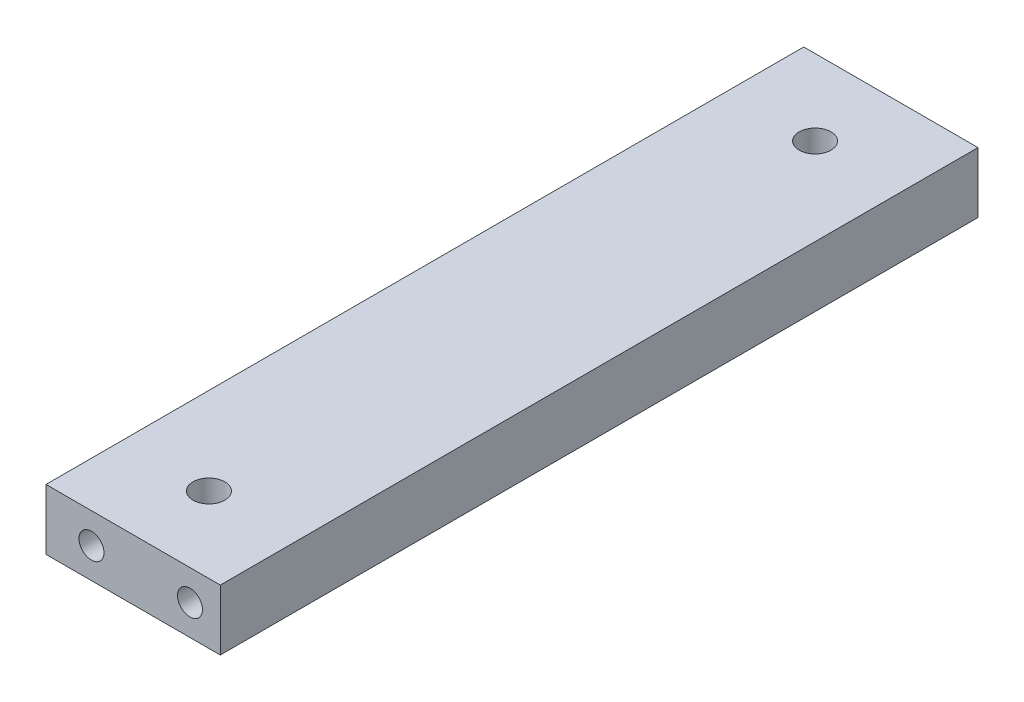
ISO-10303-21;
HEADER;
FILE_DESCRIPTION(('STEP AP214'),'2;1');
FILE_NAME('part.step','',(''),(''),'','','');
FILE_SCHEMA(('AUTOMOTIVE_DESIGN { 1 0 10303 214 1 1 1 1 }'));
ENDSEC;
DATA;
#1=APPLICATION_CONTEXT('core data for automotive mechanical design processes');
#2=APPLICATION_PROTOCOL_DEFINITION('international standard','automotive_design',2000,#1);
#3=PRODUCT_CONTEXT('',#1,'mechanical');
#4=PRODUCT('Part','Part','',(#3));
#5=PRODUCT_RELATED_PRODUCT_CATEGORY('part','',(#4));
#6=PRODUCT_DEFINITION_FORMATION('','',#4);
#7=PRODUCT_DEFINITION_CONTEXT('part definition',#1,'design');
#8=PRODUCT_DEFINITION('design','',#6,#7);
#9=PRODUCT_DEFINITION_SHAPE('','',#8);
#10=(LENGTH_UNIT() NAMED_UNIT(*) SI_UNIT(.MILLI.,.METRE.));
#11=(NAMED_UNIT(*) PLANE_ANGLE_UNIT() SI_UNIT($,.RADIAN.));
#12=(NAMED_UNIT(*) SI_UNIT($,.STERADIAN.) SOLID_ANGLE_UNIT());
#13=UNCERTAINTY_MEASURE_WITH_UNIT(LENGTH_MEASURE(1.E-05),#10,'distance_accuracy_value','');
#14=(GEOMETRIC_REPRESENTATION_CONTEXT(3) GLOBAL_UNCERTAINTY_ASSIGNED_CONTEXT((#13)) GLOBAL_UNIT_ASSIGNED_CONTEXT((#10,
#11,#12)) REPRESENTATION_CONTEXT('',''));
#15=CARTESIAN_POINT('',(0.,0.,0.));
#16=DIRECTION('',(0.,0.,1.));
#17=DIRECTION('',(1.,0.,0.));
#18=AXIS2_PLACEMENT_3D('',#15,#16,#17);
#19=CARTESIAN_POINT('',(0.,0.,100.));
#20=DIRECTION('',(1.,0.,0.));
#21=DIRECTION('',(0.,0.,-1.));
#22=AXIS2_PLACEMENT_3D('',#19,#20,#21);
#23=PLANE('',#22);
#24=DIRECTION('',(0.,-1.,0.));
#25=VECTOR('',#24,1.);
#26=CARTESIAN_POINT('',(0.,0.,0.));
#27=LINE('',#26,#25);
#28=CARTESIAN_POINT('',(0.,8.,0.));
#29=VERTEX_POINT('',#28);
#30=CARTESIAN_POINT('',(0.,0.,0.));
#31=VERTEX_POINT('',#30);
#32=EDGE_CURVE('E130',#29,#31,#27,.T.);
#33=ORIENTED_EDGE('',*,*,#32,.T.);
#34=DIRECTION('',(0.,0.,-1.));
#35=VECTOR('',#34,1.);
#36=CARTESIAN_POINT('',(0.,0.,100.));
#37=LINE('',#36,#35);
#38=CARTESIAN_POINT('',(0.,0.,100.));
#39=VERTEX_POINT('',#38);
#40=EDGE_CURVE('E11',#39,#31,#37,.T.);
#41=ORIENTED_EDGE('',*,*,#40,.F.);
#42=DIRECTION('',(0.,-1.,0.));
#43=VECTOR('',#42,1.);
#44=CARTESIAN_POINT('',(0.,0.,100.));
#45=LINE('',#44,#43);
#46=CARTESIAN_POINT('',(0.,8.,100.));
#47=VERTEX_POINT('',#46);
#48=EDGE_CURVE('E139',#47,#39,#45,.T.);
#49=ORIENTED_EDGE('',*,*,#48,.F.);
#50=DIRECTION('',(0.,0.,-1.));
#51=VECTOR('',#50,1.);
#52=CARTESIAN_POINT('',(0.,8.,100.));
#53=LINE('',#52,#51);
#54=EDGE_CURVE('E145',#47,#29,#53,.T.);
#55=ORIENTED_EDGE('',*,*,#54,.T.);
#56=EDGE_LOOP('',(#33,#41,#49,#55));
#57=FACE_BOUND('',#56,.T.);
#58=CARTESIAN_POINT('',(0.,4.,4.));
#59=DIRECTION('',(-1.,0.,0.));
#60=DIRECTION('',(0.,0.,1.));
#61=AXIS2_PLACEMENT_3D('',#58,#59,#60);
#62=CIRCLE('',#61,1.24999999999999);
#63=CARTESIAN_POINT('',(0.,4.,5.24999999999999));
#64=VERTEX_POINT('',#63);
#65=EDGE_CURVE('E227',#64,#64,#62,.T.);
#66=ORIENTED_EDGE('',*,*,#65,.F.);
#67=EDGE_LOOP('',(#66));
#68=FACE_BOUND('',#67,.T.);
#69=ADVANCED_FACE('F33',(#57,#68),#23,.F.);
#70=CARTESIAN_POINT('',(0.,0.,100.));
#71=DIRECTION('',(0.,1.,0.));
#72=DIRECTION('',(0.,0.,1.));
#73=AXIS2_PLACEMENT_3D('',#70,#71,#72);
#74=PLANE('',#73);
#75=CARTESIAN_POINT('',(11.5,0.,90.));
#76=DIRECTION('',(0.,1.,0.));
#77=DIRECTION('',(0.,0.,1.));
#78=AXIS2_PLACEMENT_3D('',#75,#76,#77);
#79=CIRCLE('',#78,2.1);
#80=CARTESIAN_POINT('',(11.5,0.,92.1));
#81=VERTEX_POINT('',#80);
#82=EDGE_CURVE('E118',#81,#81,#79,.T.);
#83=ORIENTED_EDGE('',*,*,#82,.T.);
#84=EDGE_LOOP('',(#83));
#85=FACE_BOUND('',#84,.T.);
#86=CARTESIAN_POINT('',(11.5,0.,10.));
#87=DIRECTION('',(0.,1.,0.));
#88=DIRECTION('',(0.,0.,1.));
#89=AXIS2_PLACEMENT_3D('',#86,#87,#88);
#90=CIRCLE('',#89,2.1);
#91=CARTESIAN_POINT('',(11.5,0.,12.1));
#92=VERTEX_POINT('',#91);
#93=EDGE_CURVE('E124',#92,#92,#90,.T.);
#94=ORIENTED_EDGE('',*,*,#93,.T.);
#95=EDGE_LOOP('',(#94));
#96=FACE_BOUND('',#95,.T.);
#97=DIRECTION('',(1.,0.,0.));
#98=VECTOR('',#97,1.);
#99=CARTESIAN_POINT('',(0.,0.,0.));
#100=LINE('',#99,#98);
#101=CARTESIAN_POINT('',(23.,0.,0.));
#102=VERTEX_POINT('',#101);
#103=EDGE_CURVE('E133',#31,#102,#100,.T.);
#104=ORIENTED_EDGE('',*,*,#103,.T.);
#105=DIRECTION('',(0.,0.,-1.));
#106=VECTOR('',#105,1.);
#107=CARTESIAN_POINT('',(23.,0.,100.));
#108=LINE('',#107,#106);
#109=CARTESIAN_POINT('',(23.,0.,100.));
#110=VERTEX_POINT('',#109);
#111=EDGE_CURVE('E40',#110,#102,#108,.T.);
#112=ORIENTED_EDGE('',*,*,#111,.F.);
#113=DIRECTION('',(1.,0.,0.));
#114=VECTOR('',#113,1.);
#115=CARTESIAN_POINT('',(0.,0.,100.));
#116=LINE('',#115,#114);
#117=EDGE_CURVE('E141',#39,#110,#116,.T.);
#118=ORIENTED_EDGE('',*,*,#117,.F.);
#119=ORIENTED_EDGE('',*,*,#40,.T.);
#120=EDGE_LOOP('',(#104,#112,#118,#119));
#121=FACE_BOUND('',#120,.T.);
#122=ADVANCED_FACE('F167',(#85,#96,#121),#74,.F.);
#123=CARTESIAN_POINT('',(23.,0.,100.));
#124=DIRECTION('',(-1.,0.,0.));
#125=DIRECTION('',(0.,0.,1.));
#126=AXIS2_PLACEMENT_3D('',#123,#124,#125);
#127=PLANE('',#126);
#128=DIRECTION('',(0.,1.,0.));
#129=VECTOR('',#128,1.);
#130=CARTESIAN_POINT('',(23.,0.,0.));
#131=LINE('',#130,#129);
#132=CARTESIAN_POINT('',(23.,8.,0.));
#133=VERTEX_POINT('',#132);
#134=EDGE_CURVE('E135',#102,#133,#131,.T.);
#135=ORIENTED_EDGE('',*,*,#134,.T.);
#136=DIRECTION('',(0.,0.,-1.));
#137=VECTOR('',#136,1.);
#138=CARTESIAN_POINT('',(23.,8.,100.));
#139=LINE('',#138,#137);
#140=CARTESIAN_POINT('',(23.,8.,100.));
#141=VERTEX_POINT('',#140);
#142=EDGE_CURVE('E148',#141,#133,#139,.T.);
#143=ORIENTED_EDGE('',*,*,#142,.F.);
#144=DIRECTION('',(0.,1.,0.));
#145=VECTOR('',#144,1.);
#146=CARTESIAN_POINT('',(23.,0.,100.));
#147=LINE('',#146,#145);
#148=EDGE_CURVE('E52',#110,#141,#147,.T.);
#149=ORIENTED_EDGE('',*,*,#148,.F.);
#150=ORIENTED_EDGE('',*,*,#111,.T.);
#151=EDGE_LOOP('',(#135,#143,#149,#150));
#152=FACE_BOUND('',#151,.T.);
#153=ADVANCED_FACE('F154',(#152),#127,.F.);
#154=CARTESIAN_POINT('',(0.,8.,100.));
#155=DIRECTION('',(0.,-1.,0.));
#156=DIRECTION('',(0.,0.,-1.));
#157=AXIS2_PLACEMENT_3D('',#154,#155,#156);
#158=PLANE('',#157);
#159=CARTESIAN_POINT('',(11.5,8.,90.));
#160=DIRECTION('',(0.,1.,0.));
#161=DIRECTION('',(0.,0.,1.));
#162=AXIS2_PLACEMENT_3D('',#159,#160,#161);
#163=CIRCLE('',#162,2.09999999999999);
#164=CARTESIAN_POINT('',(11.5,8.,92.1));
#165=VERTEX_POINT('',#164);
#166=EDGE_CURVE('E121',#165,#165,#163,.T.);
#167=ORIENTED_EDGE('',*,*,#166,.F.);
#168=EDGE_LOOP('',(#167));
#169=FACE_BOUND('',#168,.T.);
#170=CARTESIAN_POINT('',(11.5,8.,10.));
#171=DIRECTION('',(0.,1.,0.));
#172=DIRECTION('',(0.,0.,1.));
#173=AXIS2_PLACEMENT_3D('',#170,#171,#172);
#174=CIRCLE('',#173,2.09999999999999);
#175=CARTESIAN_POINT('',(11.5,8.,12.1));
#176=VERTEX_POINT('',#175);
#177=EDGE_CURVE('E127',#176,#176,#174,.T.);
#178=ORIENTED_EDGE('',*,*,#177,.F.);
#179=EDGE_LOOP('',(#178));
#180=FACE_BOUND('',#179,.T.);
#181=DIRECTION('',(-1.,0.,0.));
#182=VECTOR('',#181,1.);
#183=CARTESIAN_POINT('',(0.,8.,0.));
#184=LINE('',#183,#182);
#185=EDGE_CURVE('E137',#133,#29,#184,.T.);
#186=ORIENTED_EDGE('',*,*,#185,.T.);
#187=ORIENTED_EDGE('',*,*,#54,.F.);
#188=DIRECTION('',(-1.,0.,0.));
#189=VECTOR('',#188,1.);
#190=CARTESIAN_POINT('',(0.,8.,100.));
#191=LINE('',#190,#189);
#192=EDGE_CURVE('E47',#141,#47,#191,.T.);
#193=ORIENTED_EDGE('',*,*,#192,.F.);
#194=ORIENTED_EDGE('',*,*,#142,.T.);
#195=EDGE_LOOP('',(#186,#187,#193,#194));
#196=FACE_BOUND('',#195,.T.);
#197=ADVANCED_FACE('F161',(#169,#180,#196),#158,.F.);
#198=CARTESIAN_POINT('',(0.,8.,100.));
#199=DIRECTION('',(0.,0.,-1.));
#200=DIRECTION('',(-1.,0.,0.));
#201=AXIS2_PLACEMENT_3D('',#198,#199,#200);
#202=PLANE('',#201);
#203=CARTESIAN_POINT('',(6.,4.,100.));
#204=DIRECTION('',(0.,0.,1.));
#205=DIRECTION('',(1.,0.,0.));
#206=AXIS2_PLACEMENT_3D('',#203,#204,#205);
#207=CIRCLE('',#206,1.65);
#208=CARTESIAN_POINT('',(7.65,4.,100.));
#209=VERTEX_POINT('',#208);
#210=EDGE_CURVE('E94',#209,#209,#207,.T.);
#211=ORIENTED_EDGE('',*,*,#210,.F.);
#212=EDGE_LOOP('',(#211));
#213=FACE_BOUND('',#212,.T.);
#214=CARTESIAN_POINT('',(19.,4.,100.));
#215=DIRECTION('',(0.,0.,1.));
#216=DIRECTION('',(1.,0.,0.));
#217=AXIS2_PLACEMENT_3D('',#214,#215,#216);
#218=CIRCLE('',#217,1.65);
#219=CARTESIAN_POINT('',(20.65,4.,100.));
#220=VERTEX_POINT('',#219);
#221=EDGE_CURVE('E93',#220,#220,#218,.T.);
#222=ORIENTED_EDGE('',*,*,#221,.F.);
#223=EDGE_LOOP('',(#222));
#224=FACE_BOUND('',#223,.T.);
#225=ORIENTED_EDGE('',*,*,#48,.T.);
#226=ORIENTED_EDGE('',*,*,#117,.T.);
#227=ORIENTED_EDGE('',*,*,#148,.T.);
#228=ORIENTED_EDGE('',*,*,#192,.T.);
#229=EDGE_LOOP('',(#225,#226,#227,#228));
#230=FACE_BOUND('',#229,.T.);
#231=ADVANCED_FACE('F166',(#213,#224,#230),#202,.F.);
#232=CARTESIAN_POINT('',(0.,8.,0.));
#233=DIRECTION('',(0.,0.,-1.));
#234=DIRECTION('',(-1.,0.,0.));
#235=AXIS2_PLACEMENT_3D('',#232,#233,#234);
#236=PLANE('',#235);
#237=CARTESIAN_POINT('',(19.,4.,0.));
#238=DIRECTION('',(0.,0.,-1.));
#239=DIRECTION('',(-1.,0.,0.));
#240=AXIS2_PLACEMENT_3D('',#237,#238,#239);
#241=CIRCLE('',#240,1.65);
#242=CARTESIAN_POINT('',(17.35,4.,0.));
#243=VERTEX_POINT('',#242);
#244=EDGE_CURVE('E106',#243,#243,#241,.T.);
#245=ORIENTED_EDGE('',*,*,#244,.F.);
#246=EDGE_LOOP('',(#245));
#247=FACE_BOUND('',#246,.T.);
#248=CARTESIAN_POINT('',(4.,4.,0.));
#249=DIRECTION('',(0.,0.,-1.));
#250=DIRECTION('',(-1.,0.,0.));
#251=AXIS2_PLACEMENT_3D('',#248,#249,#250);
#252=CIRCLE('',#251,1.65);
#253=CARTESIAN_POINT('',(2.35,4.,0.));
#254=VERTEX_POINT('',#253);
#255=EDGE_CURVE('E112',#254,#254,#252,.T.);
#256=ORIENTED_EDGE('',*,*,#255,.F.);
#257=EDGE_LOOP('',(#256));
#258=FACE_BOUND('',#257,.T.);
#259=ORIENTED_EDGE('',*,*,#32,.F.);
#260=ORIENTED_EDGE('',*,*,#185,.F.);
#261=ORIENTED_EDGE('',*,*,#134,.F.);
#262=ORIENTED_EDGE('',*,*,#103,.F.);
#263=EDGE_LOOP('',(#259,#260,#261,#262));
#264=FACE_BOUND('',#263,.T.);
#265=ADVANCED_FACE('F159',(#247,#258,#264),#236,.T.);
#266=CARTESIAN_POINT('',(11.5,8.,10.));
#267=DIRECTION('',(0.,1.,0.));
#268=DIRECTION('',(0.,0.,1.));
#269=AXIS2_PLACEMENT_3D('',#266,#267,#268);
#270=CYLINDRICAL_SURFACE('',#269,2.09999999999999);
#271=ORIENTED_EDGE('',*,*,#93,.F.);
#272=EDGE_LOOP('',(#271));
#273=FACE_BOUND('',#272,.T.);
#274=ORIENTED_EDGE('',*,*,#177,.T.);
#275=EDGE_LOOP('',(#274));
#276=FACE_BOUND('',#275,.T.);
#277=ADVANCED_FACE('F185',(#273,#276),#270,.F.);
#278=CARTESIAN_POINT('',(11.5,8.,90.));
#279=DIRECTION('',(0.,1.,0.));
#280=DIRECTION('',(0.,0.,1.));
#281=AXIS2_PLACEMENT_3D('',#278,#279,#280);
#282=CYLINDRICAL_SURFACE('',#281,2.09999999999999);
#283=ORIENTED_EDGE('',*,*,#82,.F.);
#284=EDGE_LOOP('',(#283));
#285=FACE_BOUND('',#284,.T.);
#286=ORIENTED_EDGE('',*,*,#166,.T.);
#287=EDGE_LOOP('',(#286));
#288=FACE_BOUND('',#287,.T.);
#289=ADVANCED_FACE('F189',(#285,#288),#282,.F.);
#290=CARTESIAN_POINT('',(4.,4.,10.));
#291=DIRECTION('',(0.,0.,-1.));
#292=DIRECTION('',(-1.,0.,0.));
#293=AXIS2_PLACEMENT_3D('',#290,#291,#292);
#294=CONICAL_SURFACE('',#293,1.65,1.02974425867665);
#295=CARTESIAN_POINT('',(4.,4.,10.9914200213955));
#296=VERTEX_POINT('',#295);
#297=VERTEX_LOOP('',#296);
#298=FACE_BOUND('',#297,.T.);
#299=CARTESIAN_POINT('',(4.,4.,10.));
#300=DIRECTION('',(0.,0.,-1.));
#301=DIRECTION('',(-1.,0.,0.));
#302=AXIS2_PLACEMENT_3D('',#299,#300,#301);
#303=CIRCLE('',#302,1.65);
#304=CARTESIAN_POINT('',(2.35,4.,10.));
#305=VERTEX_POINT('',#304);
#306=EDGE_CURVE('E115',#305,#305,#303,.T.);
#307=ORIENTED_EDGE('',*,*,#306,.T.);
#308=EDGE_LOOP('',(#307));
#309=FACE_BOUND('',#308,.T.);
#310=ADVANCED_FACE('F193',(#298,#309),#294,.F.);
#311=CARTESIAN_POINT('',(4.,4.,0.));
#312=DIRECTION('',(0.,0.,-1.));
#313=DIRECTION('',(-1.,0.,0.));
#314=AXIS2_PLACEMENT_3D('',#311,#312,#313);
#315=CYLINDRICAL_SURFACE('',#314,1.65);
#316=CARTESIAN_POINT('',(2.35,4.,5.24999999999999));
#317=CARTESIAN_POINT('',(2.35000458652933,4.06088296339741,5.2499952332996));
#318=CARTESIAN_POINT('',(2.35340454548149,4.12184903642118,5.24551653855051));
#319=CARTESIAN_POINT('',(2.36669818443269,4.24184584982821,5.22788720832699));
#320=CARTESIAN_POINT('',(2.37660576436012,4.30087216298013,5.21471801012175));
#321=CARTESIAN_POINT('',(2.40196488867894,4.4149442015703,5.18061224777241));
#322=CARTESIAN_POINT('',(2.41738321079617,4.47001145517649,5.15972220463485));
#323=CARTESIAN_POINT('',(2.45261122399545,4.57548611074105,5.11116635227754));
#324=CARTESIAN_POINT('',(2.47242008081434,4.62589439539384,5.08350183019924));
#325=CARTESIAN_POINT('',(2.51718419332322,4.72597143098731,5.01946918140191));
#326=CARTESIAN_POINT('',(2.54244682165135,4.77513483981222,4.98253068455901));
#327=CARTESIAN_POINT('',(2.59512854679337,4.86697515775556,4.90253556672795));
#328=CARTESIAN_POINT('',(2.62255085518806,4.90964211896389,4.8594697543028));
#329=CARTESIAN_POINT('',(2.68354482316029,4.99639458981569,4.75830160788268));
#330=CARTESIAN_POINT('',(2.71721304146494,5.03894132640253,4.69893276115347));
#331=CARTESIAN_POINT('',(2.78150139958024,5.11363168831071,4.57245602252275));
#332=CARTESIAN_POINT('',(2.8121254426642,5.14578875767428,4.50535828550262));
#333=CARTESIAN_POINT('',(2.85589377708051,5.18916834378204,4.3883274008683));
#334=CARTESIAN_POINT('',(2.87141176009329,5.20378152042509,4.3405511503274));
#335=CARTESIAN_POINT('',(2.89706827903535,5.22733317333639,4.24227076591183));
#336=CARTESIAN_POINT('',(2.90721928631795,5.23628481502272,4.19177325932462));
#337=CARTESIAN_POINT('',(2.92054481036541,5.24794370445191,4.08859928395235));
#338=CARTESIAN_POINT('',(2.92365151100617,5.25059026486483,4.03590656679152));
#339=CARTESIAN_POINT('',(2.92202410231704,5.24918701251135,3.93072332849998));
#340=CARTESIAN_POINT('',(2.91728794643681,5.24513545190747,3.87823286372862));
#341=CARTESIAN_POINT('',(2.90189214091698,5.23156157310536,3.78117281792648));
#342=CARTESIAN_POINT('',(2.89196838343885,5.22271471961542,3.73638188154592));
#343=CARTESIAN_POINT('',(2.86801303565716,5.20057163787402,3.64905873597814));
#344=CARTESIAN_POINT('',(2.85397731632828,5.18727093536222,3.60652884818644));
#345=CARTESIAN_POINT('',(2.81325386432306,5.14690386500372,3.49769106616164));
#346=CARTESIAN_POINT('',(2.78420605711662,5.11646821468428,3.43351711512154));
#347=CARTESIAN_POINT('',(2.72312456226637,5.04607644886703,3.31213020761417));
#348=CARTESIAN_POINT('',(2.69108359615774,5.006096737888,3.25493504270472));
#349=CARTESIAN_POINT('',(2.62638619819974,4.9158903167241,3.14632506611765));
#350=CARTESIAN_POINT('',(2.59373758846361,4.8654084767559,3.09511644971519));
#351=CARTESIAN_POINT('',(2.53167099632841,4.75530872039026,3.00139311893699));
#352=CARTESIAN_POINT('',(2.50224704228341,4.69570819863156,2.95886220419815));
#353=CARTESIAN_POINT('',(2.45444917149692,4.58041127870777,2.8913177052297));
#354=CARTESIAN_POINT('',(2.43503898193339,4.52620240137962,2.86450635793614));
#355=CARTESIAN_POINT('',(2.40145103884511,4.41305508274507,2.81864332594816));
#356=CARTESIAN_POINT('',(2.38727012452799,4.35411952475929,2.79958695309938));
#357=CARTESIAN_POINT('',(2.36528915789714,4.23250547062643,2.77021321474634));
#358=CARTESIAN_POINT('',(2.35753102259551,4.16980520696579,2.75995324200773));
#359=CARTESIAN_POINT('',(2.34934436120256,4.04310385821354,2.74912930922627));
#360=CARTESIAN_POINT('',(2.34891217823413,3.97910343809262,2.74856051166329));
#361=CARTESIAN_POINT('',(2.35505741621176,3.85894809680008,2.75668159706521));
#362=CARTESIAN_POINT('',(2.36089279479122,3.8026838915636,2.76439132526081));
#363=CARTESIAN_POINT('',(2.37794689416787,3.69250582101934,2.78710574964074));
#364=CARTESIAN_POINT('',(2.38916667378112,3.63859242026138,2.80211188063458));
#365=CARTESIAN_POINT('',(2.41655576296171,3.53279828051072,2.83920007793287));
#366=CARTESIAN_POINT('',(2.43285678891883,3.48101898896197,2.86147128489899));
#367=CARTESIAN_POINT('',(2.4692094978617,3.38196442812469,2.91205318379885));
#368=CARTESIAN_POINT('',(2.48926173283701,3.33468982324704,2.9403647646585));
#369=CARTESIAN_POINT('',(2.53553227096769,3.2376492307977,3.00735220823471));
#370=CARTESIAN_POINT('',(2.5622220716194,3.18875868231043,3.04696735301552));
#371=CARTESIAN_POINT('',(2.61743046004382,3.09787031709587,3.1324943088009));
#372=CARTESIAN_POINT('',(2.64595274605603,3.05588708939659,3.17841908058304));
#373=CARTESIAN_POINT('',(2.70848187756518,2.97153364574557,3.2856494697084));
#374=CARTESIAN_POINT('',(2.74246139910773,2.93071893630049,3.34820241244755));
#375=CARTESIAN_POINT('',(2.80600534604605,2.86021231152483,3.48132103554713));
#376=CARTESIAN_POINT('',(2.83558065056404,2.83049270603762,3.55186618766713));
#377=CARTESIAN_POINT('',(2.87490199635074,2.79289900291479,3.67183494153459));
#378=CARTESIAN_POINT('',(2.88789755249085,2.78101991115166,3.71892307638749));
#379=CARTESIAN_POINT('',(2.90825163294376,2.76275502312949,3.8152889155424));
#380=CARTESIAN_POINT('',(2.91562344415606,2.75635627435817,3.86456116601973));
#381=CARTESIAN_POINT('',(2.92353270681249,2.74949979900039,3.96442387422978));
#382=CARTESIAN_POINT('',(2.92402489243214,2.74908142101077,4.01502087018999));
#383=CARTESIAN_POINT('',(2.91795906732075,2.7543275507758,4.11549062774537));
#384=CARTESIAN_POINT('',(2.91139345159,2.75999862009138,4.16536254930784));
#385=CARTESIAN_POINT('',(2.89069943345105,2.77845562683078,4.27152400337414));
#386=CARTESIAN_POINT('',(2.87544277499148,2.79231868137025,4.32739696749354));
#387=CARTESIAN_POINT('',(2.83949188379045,2.82682509236684,4.43518004959378));
#388=CARTESIAN_POINT('',(2.81878366939327,2.84748591766439,4.48707952846088));
#389=CARTESIAN_POINT('',(2.7659231195102,2.90384650810145,4.60559480634283));
#390=CARTESIAN_POINT('',(2.73241358849386,2.94227744413036,4.67030101763592));
#391=CARTESIAN_POINT('',(2.66432049935063,3.02966766949312,4.79154486327357));
#392=CARTESIAN_POINT('',(2.62973580794947,3.07863841408927,4.8480734970879));
#393=CARTESIAN_POINT('',(2.5625103421861,3.18742988931585,4.95289339062745));
#394=CARTESIAN_POINT('',(2.52990046865731,3.2473826688907,5.00106874522813));
#395=CARTESIAN_POINT('',(2.47044180834827,3.37709790804409,5.08650076844531));
#396=CARTESIAN_POINT('',(2.44357949815953,3.44683668686297,5.12378314442877));
#397=CARTESIAN_POINT('',(2.40520479975002,3.57320216560249,5.17626043806442));
#398=CARTESIAN_POINT('',(2.3914997189029,3.62781699770075,5.19472427813608));
#399=CARTESIAN_POINT('',(2.36961026428823,3.74005044761704,5.22403749756539));
#400=CARTESIAN_POINT('',(2.3614119064172,3.7976610534078,5.23490616741475));
#401=CARTESIAN_POINT('',(2.35420861350927,3.87979766589888,5.24444023164282));
#402=CARTESIAN_POINT('',(2.35263385546447,3.90375725447922,5.24652159470469));
#403=CARTESIAN_POINT('',(2.35052852681578,3.95180686854764,5.2493025732977));
#404=CARTESIAN_POINT('',(2.3499981842297,3.97589692136792,5.25000188709858));
#405=CARTESIAN_POINT('',(2.35,4.,5.24999999999999));
#406=B_SPLINE_CURVE_WITH_KNOTS('',3,(#316,#317,#318,#319,#320,#321,#322,#323,#324,#325,#326,
#327,#328,#329,#330,#331,#332,#333,#334,#335,#336,#337,#338,#339,#340,#341,#342,#343,#344,#345,
#346,#347,#348,#349,#350,#351,#352,#353,#354,#355,#356,#357,#358,#359,#360,#361,#362,#363,#364,
#365,#366,#367,#368,#369,#370,#371,#372,#373,#374,#375,#376,#377,#378,#379,#380,#381,#382,#383,
#384,#385,#386,#387,#388,#389,#390,#391,#392,#393,#394,#395,#396,#397,#398,#399,#400,#401,#402,
#403,#404,#405),.UNSPECIFIED.,.T.,.F.,(4,2,2,2,2,2,2,2,2,2,2,2,2,2,2,2,2,2,2,2,2,2,2,2,2,2,2,2,
2,2,2,2,2,2,2,2,2,2,2,2,2,2,2,2,4),(0.,0.182544837100256,0.365480853652026,0.547332118891944,
0.729148859419205,0.927885054752799,1.12692257568281,1.36721199200182,1.6071892211458,
1.76361888123479,1.91968342686577,2.07724415295095,2.23484600012198,2.37450232940634,
2.51429937805255,2.74325380921192,2.9727802486459,3.20872076052623,3.44421668236897,
3.63400440217132,3.82367721758043,4.01457834901151,4.20538418599998,4.37585757576129,
4.54636450202386,4.72172170093673,4.89710472394845,5.10141880203102,5.3061590230653,
5.55126367740737,5.79575246621727,5.94603426155454,6.09595988556512,6.24687151326622,
6.39794591607551,6.57562616152411,6.75376662140643,6.99965448654951,7.24581095842495,
7.49514884123257,7.74389344499285,7.92096529432787,8.09758575930351,8.16983802897293,
8.24210607108165),.UNSPECIFIED.);
#407=CARTESIAN_POINT('',(2.35,4.,5.24999999999999));
#408=VERTEX_POINT('',#407);
#409=EDGE_CURVE('E100',#408,#408,#406,.T.);
#410=ORIENTED_EDGE('',*,*,#409,.T.);
#411=EDGE_LOOP('',(#410));
#412=FACE_BOUND('',#411,.T.);
#413=ORIENTED_EDGE('',*,*,#306,.F.);
#414=EDGE_LOOP('',(#413));
#415=FACE_BOUND('',#414,.T.);
#416=ORIENTED_EDGE('',*,*,#255,.T.);
#417=EDGE_LOOP('',(#416));
#418=FACE_BOUND('',#417,.T.);
#419=ADVANCED_FACE('F197',(#412,#415,#418),#315,.F.);
#420=CARTESIAN_POINT('',(19.,4.,10.));
#421=DIRECTION('',(0.,0.,-1.));
#422=DIRECTION('',(-1.,0.,0.));
#423=AXIS2_PLACEMENT_3D('',#420,#421,#422);
#424=CONICAL_SURFACE('',#423,1.65,1.02974425867665);
#425=CARTESIAN_POINT('',(19.,4.,10.9914200213955));
#426=VERTEX_POINT('',#425);
#427=VERTEX_LOOP('',#426);
#428=FACE_BOUND('',#427,.T.);
#429=CARTESIAN_POINT('',(19.,4.,10.));
#430=DIRECTION('',(0.,0.,-1.));
#431=DIRECTION('',(-1.,0.,0.));
#432=AXIS2_PLACEMENT_3D('',#429,#430,#431);
#433=CIRCLE('',#432,1.65);
#434=CARTESIAN_POINT('',(17.35,4.,10.));
#435=VERTEX_POINT('',#434);
#436=EDGE_CURVE('E109',#435,#435,#433,.T.);
#437=ORIENTED_EDGE('',*,*,#436,.T.);
#438=EDGE_LOOP('',(#437));
#439=FACE_BOUND('',#438,.T.);
#440=ADVANCED_FACE('F201',(#428,#439),#424,.F.);
#441=CARTESIAN_POINT('',(19.,4.,0.));
#442=DIRECTION('',(0.,0.,-1.));
#443=DIRECTION('',(-1.,0.,0.));
#444=AXIS2_PLACEMENT_3D('',#441,#442,#443);
#445=CYLINDRICAL_SURFACE('',#444,1.65);
#446=ORIENTED_EDGE('',*,*,#436,.F.);
#447=EDGE_LOOP('',(#446));
#448=FACE_BOUND('',#447,.T.);
#449=ORIENTED_EDGE('',*,*,#244,.T.);
#450=EDGE_LOOP('',(#449));
#451=FACE_BOUND('',#450,.T.);
#452=ADVANCED_FACE('F205',(#448,#451),#445,.F.);
#453=CARTESIAN_POINT('',(19.,4.,90.));
#454=DIRECTION('',(0.,0.,1.));
#455=DIRECTION('',(1.,0.,0.));
#456=AXIS2_PLACEMENT_3D('',#453,#454,#455);
#457=CONICAL_SURFACE('',#456,1.65,1.02974425867666);
#458=CARTESIAN_POINT('',(19.,4.,89.0085799786045));
#459=VERTEX_POINT('',#458);
#460=VERTEX_LOOP('',#459);
#461=FACE_BOUND('',#460,.T.);
#462=CARTESIAN_POINT('',(19.,4.,90.));
#463=DIRECTION('',(0.,0.,1.));
#464=DIRECTION('',(1.,0.,0.));
#465=AXIS2_PLACEMENT_3D('',#462,#463,#464);
#466=CIRCLE('',#465,1.65);
#467=CARTESIAN_POINT('',(20.65,4.,90.));
#468=VERTEX_POINT('',#467);
#469=EDGE_CURVE('E97',#468,#468,#466,.T.);
#470=ORIENTED_EDGE('',*,*,#469,.T.);
#471=EDGE_LOOP('',(#470));
#472=FACE_BOUND('',#471,.T.);
#473=ADVANCED_FACE('F209',(#461,#472),#457,.F.);
#474=CARTESIAN_POINT('',(19.,4.,100.));
#475=DIRECTION('',(0.,0.,1.));
#476=DIRECTION('',(1.,0.,0.));
#477=AXIS2_PLACEMENT_3D('',#474,#475,#476);
#478=CYLINDRICAL_SURFACE('',#477,1.65);
#479=ORIENTED_EDGE('',*,*,#469,.F.);
#480=EDGE_LOOP('',(#479));
#481=FACE_BOUND('',#480,.T.);
#482=ORIENTED_EDGE('',*,*,#221,.T.);
#483=EDGE_LOOP('',(#482));
#484=FACE_BOUND('',#483,.T.);
#485=ADVANCED_FACE('F87',(#481,#484),#478,.F.);
#486=CARTESIAN_POINT('',(6.,4.,90.));
#487=DIRECTION('',(0.,0.,1.));
#488=DIRECTION('',(1.,0.,0.));
#489=AXIS2_PLACEMENT_3D('',#486,#487,#488);
#490=CONICAL_SURFACE('',#489,1.64999999999999,1.02974425867666);
#491=CARTESIAN_POINT('',(6.,4.,89.0085799786045));
#492=VERTEX_POINT('',#491);
#493=VERTEX_LOOP('',#492);
#494=FACE_BOUND('',#493,.T.);
#495=CARTESIAN_POINT('',(6.,4.,90.));
#496=DIRECTION('',(0.,0.,1.));
#497=DIRECTION('',(1.,0.,0.));
#498=AXIS2_PLACEMENT_3D('',#495,#496,#497);
#499=CIRCLE('',#498,1.64999999999999);
#500=CARTESIAN_POINT('',(7.65,4.,90.));
#501=VERTEX_POINT('',#500);
#502=EDGE_CURVE('E91',#501,#501,#499,.T.);
#503=ORIENTED_EDGE('',*,*,#502,.T.);
#504=EDGE_LOOP('',(#503));
#505=FACE_BOUND('',#504,.T.);
#506=ADVANCED_FACE('F83',(#494,#505),#490,.F.);
#507=CARTESIAN_POINT('',(6.,4.,100.));
#508=DIRECTION('',(0.,0.,1.));
#509=DIRECTION('',(1.,0.,0.));
#510=AXIS2_PLACEMENT_3D('',#507,#508,#509);
#511=CYLINDRICAL_SURFACE('',#510,1.65);
#512=ORIENTED_EDGE('',*,*,#502,.F.);
#513=EDGE_LOOP('',(#512));
#514=FACE_BOUND('',#513,.T.);
#515=ORIENTED_EDGE('',*,*,#210,.T.);
#516=EDGE_LOOP('',(#515));
#517=FACE_BOUND('',#516,.T.);
#518=ADVANCED_FACE('F86',(#514,#517),#511,.F.);
#519=CARTESIAN_POINT('',(0.,4.,4.));
#520=DIRECTION('',(-1.,0.,0.));
#521=DIRECTION('',(0.,0.,1.));
#522=AXIS2_PLACEMENT_3D('',#519,#520,#521);
#523=CYLINDRICAL_SURFACE('',#522,1.24999999999999);
#524=ORIENTED_EDGE('',*,*,#409,.F.);
#525=EDGE_LOOP('',(#524));
#526=FACE_BOUND('',#525,.T.);
#527=ORIENTED_EDGE('',*,*,#65,.T.);
#528=EDGE_LOOP('',(#527));
#529=FACE_BOUND('',#528,.T.);
#530=ADVANCED_FACE('F219',(#526,#529),#523,.F.);
#531=CLOSED_SHELL('',(#69,#122,#153,#197,#231,#265,#277,#289,#310,#419,#440,#452,#473,#485,#506,
#518,#530));
#532=MANIFOLD_SOLID_BREP('B2',#531);
#533=ADVANCED_BREP_SHAPE_REPRESENTATION('',(#18,#532),#14);
#534=SHAPE_DEFINITION_REPRESENTATION(#9,#533);
ENDSEC;
END-ISO-10303-21;
